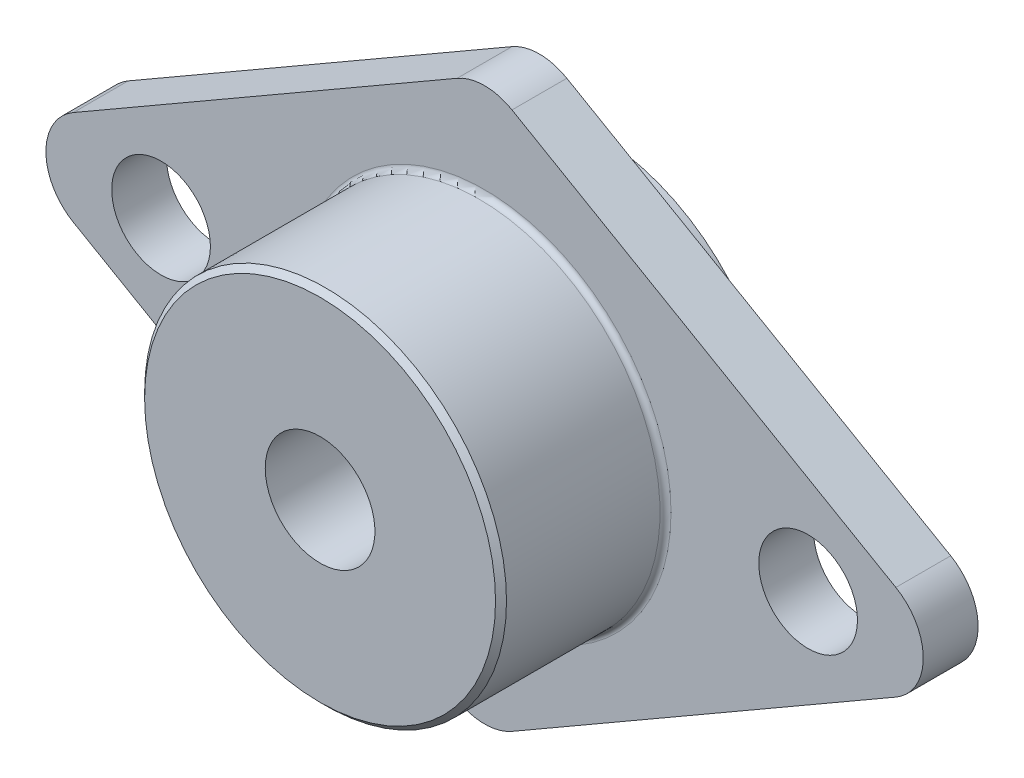
ISO-10303-21;
HEADER;
FILE_DESCRIPTION(('STEP AP214'),'2;1');
FILE_NAME('part.step','',(''),(''),'','','');
FILE_SCHEMA(('AUTOMOTIVE_DESIGN { 1 0 10303 214 1 1 1 1 }'));
ENDSEC;
DATA;
#1=APPLICATION_CONTEXT('core data for automotive mechanical design processes');
#2=APPLICATION_PROTOCOL_DEFINITION('international standard','automotive_design',2000,#1);
#3=PRODUCT_CONTEXT('',#1,'mechanical');
#4=PRODUCT('Part','Part','',(#3));
#5=PRODUCT_RELATED_PRODUCT_CATEGORY('part','',(#4));
#6=PRODUCT_DEFINITION_FORMATION('','',#4);
#7=PRODUCT_DEFINITION_CONTEXT('part definition',#1,'design');
#8=PRODUCT_DEFINITION('design','',#6,#7);
#9=PRODUCT_DEFINITION_SHAPE('','',#8);
#10=(LENGTH_UNIT() NAMED_UNIT(*) SI_UNIT(.MILLI.,.METRE.));
#11=(NAMED_UNIT(*) PLANE_ANGLE_UNIT() SI_UNIT($,.RADIAN.));
#12=(NAMED_UNIT(*) SI_UNIT($,.STERADIAN.) SOLID_ANGLE_UNIT());
#13=UNCERTAINTY_MEASURE_WITH_UNIT(LENGTH_MEASURE(1.E-05),#10,'distance_accuracy_value','');
#14=(GEOMETRIC_REPRESENTATION_CONTEXT(3) GLOBAL_UNCERTAINTY_ASSIGNED_CONTEXT((#13)) GLOBAL_UNIT_ASSIGNED_CONTEXT((#10,
#11,#12)) REPRESENTATION_CONTEXT('',''));
#15=CARTESIAN_POINT('',(0.,0.,0.));
#16=DIRECTION('',(0.,0.,1.));
#17=DIRECTION('',(1.,0.,0.));
#18=AXIS2_PLACEMENT_3D('',#15,#16,#17);
#19=CARTESIAN_POINT('',(0.,-20.2072594216368,5.));
#20=DIRECTION('',(0.,0.,-1.));
#21=DIRECTION('',(-1.,0.,0.));
#22=AXIS2_PLACEMENT_3D('',#19,#20,#21);
#23=CYLINDRICAL_SURFACE('',#22,5.);
#24=CARTESIAN_POINT('',(0.,-20.2072594216368,0.));
#25=DIRECTION('',(0.,0.,1.));
#26=DIRECTION('',(-1.,0.,0.));
#27=AXIS2_PLACEMENT_3D('',#24,#25,#26);
#28=CIRCLE('',#27,5.);
#29=CARTESIAN_POINT('',(-2.49999999999999,-24.537386440559,0.));
#30=VERTEX_POINT('',#29);
#31=CARTESIAN_POINT('',(2.49999999999999,-24.537386440559,0.));
#32=VERTEX_POINT('',#31);
#33=EDGE_CURVE('E145',#30,#32,#28,.T.);
#34=ORIENTED_EDGE('',*,*,#33,.T.);
#35=DIRECTION('',(0.,0.,-1.));
#36=VECTOR('',#35,1.);
#37=CARTESIAN_POINT('',(2.49999999999999,-24.537386440559,5.));
#38=LINE('',#37,#36);
#39=CARTESIAN_POINT('',(2.49999999999999,-24.537386440559,5.));
#40=VERTEX_POINT('',#39);
#41=EDGE_CURVE('E173',#40,#32,#38,.T.);
#42=ORIENTED_EDGE('',*,*,#41,.F.);
#43=CARTESIAN_POINT('',(0.,-20.2072594216368,5.));
#44=DIRECTION('',(0.,0.,1.));
#45=DIRECTION('',(-1.,0.,0.));
#46=AXIS2_PLACEMENT_3D('',#43,#44,#45);
#47=CIRCLE('',#46,5.);
#48=CARTESIAN_POINT('',(-2.49999999999999,-24.537386440559,5.));
#49=VERTEX_POINT('',#48);
#50=EDGE_CURVE('E160',#49,#40,#47,.T.);
#51=ORIENTED_EDGE('',*,*,#50,.F.);
#52=DIRECTION('',(0.,0.,-1.));
#53=VECTOR('',#52,1.);
#54=CARTESIAN_POINT('',(-2.49999999999999,-24.537386440559,5.));
#55=LINE('',#54,#53);
#56=EDGE_CURVE('E141',#49,#30,#55,.T.);
#57=ORIENTED_EDGE('',*,*,#56,.T.);
#58=EDGE_LOOP('',(#34,#42,#51,#57));
#59=FACE_BOUND('',#58,.T.);
#60=ADVANCED_FACE('F47',(#59),#23,.T.);
#61=CARTESIAN_POINT('',(37.4999999999999,-4.3301270189222,5.));
#62=DIRECTION('',(-0.499999999999998,0.86602540378444,0.));
#63=DIRECTION('',(-0.86602540378444,-0.499999999999998,0.));
#64=AXIS2_PLACEMENT_3D('',#61,#62,#63);
#65=PLANE('',#64);
#66=DIRECTION('',(0.86602540378444,0.499999999999998,0.));
#67=VECTOR('',#66,1.);
#68=CARTESIAN_POINT('',(37.4999999999999,-4.3301270189222,0.));
#69=LINE('',#68,#67);
#70=CARTESIAN_POINT('',(37.4999999999999,-4.3301270189222,0.));
#71=VERTEX_POINT('',#70);
#72=EDGE_CURVE('E148',#32,#71,#69,.T.);
#73=ORIENTED_EDGE('',*,*,#72,.T.);
#74=DIRECTION('',(0.,0.,-1.));
#75=VECTOR('',#74,1.);
#76=CARTESIAN_POINT('',(37.4999999999999,-4.3301270189222,5.));
#77=LINE('',#76,#75);
#78=CARTESIAN_POINT('',(37.4999999999999,-4.3301270189222,5.));
#79=VERTEX_POINT('',#78);
#80=EDGE_CURVE('E170',#79,#71,#77,.T.);
#81=ORIENTED_EDGE('',*,*,#80,.F.);
#82=DIRECTION('',(0.86602540378444,0.499999999999998,0.));
#83=VECTOR('',#82,1.);
#84=CARTESIAN_POINT('',(37.4999999999999,-4.3301270189222,5.));
#85=LINE('',#84,#83);
#86=EDGE_CURVE('E108',#40,#79,#85,.T.);
#87=ORIENTED_EDGE('',*,*,#86,.F.);
#88=ORIENTED_EDGE('',*,*,#41,.T.);
#89=EDGE_LOOP('',(#73,#81,#87,#88));
#90=FACE_BOUND('',#89,.T.);
#91=ADVANCED_FACE('F202',(#90),#65,.F.);
#92=CARTESIAN_POINT('',(35.,0.,5.));
#93=DIRECTION('',(0.,0.,-1.));
#94=DIRECTION('',(-1.,0.,0.));
#95=AXIS2_PLACEMENT_3D('',#92,#93,#94);
#96=CYLINDRICAL_SURFACE('',#95,5.);
#97=CARTESIAN_POINT('',(35.,0.,0.));
#98=DIRECTION('',(0.,0.,1.));
#99=DIRECTION('',(-1.,0.,0.));
#100=AXIS2_PLACEMENT_3D('',#97,#98,#99);
#101=CIRCLE('',#100,5.);
#102=CARTESIAN_POINT('',(37.4999999999999,4.33012701892221,0.));
#103=VERTEX_POINT('',#102);
#104=EDGE_CURVE('E151',#71,#103,#101,.T.);
#105=ORIENTED_EDGE('',*,*,#104,.T.);
#106=DIRECTION('',(0.,0.,-1.));
#107=VECTOR('',#106,1.);
#108=CARTESIAN_POINT('',(37.4999999999999,4.33012701892221,5.));
#109=LINE('',#108,#107);
#110=CARTESIAN_POINT('',(37.4999999999999,4.33012701892221,5.));
#111=VERTEX_POINT('',#110);
#112=EDGE_CURVE('E167',#111,#103,#109,.T.);
#113=ORIENTED_EDGE('',*,*,#112,.F.);
#114=CARTESIAN_POINT('',(35.,0.,5.));
#115=DIRECTION('',(0.,0.,1.));
#116=DIRECTION('',(-1.,0.,0.));
#117=AXIS2_PLACEMENT_3D('',#114,#115,#116);
#118=CIRCLE('',#117,5.);
#119=EDGE_CURVE('E242',#79,#111,#118,.T.);
#120=ORIENTED_EDGE('',*,*,#119,.F.);
#121=ORIENTED_EDGE('',*,*,#80,.T.);
#122=EDGE_LOOP('',(#105,#113,#120,#121));
#123=FACE_BOUND('',#122,.T.);
#124=ADVANCED_FACE('F208',(#123),#96,.T.);
#125=CARTESIAN_POINT('',(2.49999999999998,24.537386440559,5.));
#126=DIRECTION('',(-0.499999999999998,-0.86602540378444,0.));
#127=DIRECTION('',(0.86602540378444,-0.499999999999998,0.));
#128=AXIS2_PLACEMENT_3D('',#125,#126,#127);
#129=PLANE('',#128);
#130=DIRECTION('',(-0.86602540378444,0.499999999999998,0.));
#131=VECTOR('',#130,1.);
#132=CARTESIAN_POINT('',(2.49999999999998,24.537386440559,0.));
#133=LINE('',#132,#131);
#134=CARTESIAN_POINT('',(2.49999999999998,24.537386440559,0.));
#135=VERTEX_POINT('',#134);
#136=EDGE_CURVE('E153',#103,#135,#133,.T.);
#137=ORIENTED_EDGE('',*,*,#136,.T.);
#138=DIRECTION('',(0.,0.,-1.));
#139=VECTOR('',#138,1.);
#140=CARTESIAN_POINT('',(2.49999999999998,24.537386440559,5.));
#141=LINE('',#140,#139);
#142=CARTESIAN_POINT('',(2.49999999999998,24.537386440559,5.));
#143=VERTEX_POINT('',#142);
#144=EDGE_CURVE('E164',#143,#135,#141,.T.);
#145=ORIENTED_EDGE('',*,*,#144,.F.);
#146=DIRECTION('',(-0.86602540378444,0.499999999999998,0.));
#147=VECTOR('',#146,1.);
#148=CARTESIAN_POINT('',(2.49999999999998,24.537386440559,5.));
#149=LINE('',#148,#147);
#150=EDGE_CURVE('E244',#111,#143,#149,.T.);
#151=ORIENTED_EDGE('',*,*,#150,.F.);
#152=ORIENTED_EDGE('',*,*,#112,.T.);
#153=EDGE_LOOP('',(#137,#145,#151,#152));
#154=FACE_BOUND('',#153,.T.);
#155=ADVANCED_FACE('F250',(#154),#129,.F.);
#156=CARTESIAN_POINT('',(0.,20.2072594216368,5.));
#157=DIRECTION('',(0.,0.,-1.));
#158=DIRECTION('',(-1.,0.,0.));
#159=AXIS2_PLACEMENT_3D('',#156,#157,#158);
#160=CYLINDRICAL_SURFACE('',#159,5.);
#161=CARTESIAN_POINT('',(0.,20.2072594216368,0.));
#162=DIRECTION('',(0.,0.,1.));
#163=DIRECTION('',(1.,0.,0.));
#164=AXIS2_PLACEMENT_3D('',#161,#162,#163);
#165=CIRCLE('',#164,5.);
#166=CARTESIAN_POINT('',(-2.49999999999999,24.537386440559,0.));
#167=VERTEX_POINT('',#166);
#168=EDGE_CURVE('E155',#135,#167,#165,.T.);
#169=ORIENTED_EDGE('',*,*,#168,.T.);
#170=DIRECTION('',(0.,0.,-1.));
#171=VECTOR('',#170,1.);
#172=CARTESIAN_POINT('',(-2.49999999999999,24.537386440559,5.));
#173=LINE('',#172,#171);
#174=CARTESIAN_POINT('',(-2.49999999999999,24.537386440559,5.));
#175=VERTEX_POINT('',#174);
#176=EDGE_CURVE('E136',#175,#167,#173,.T.);
#177=ORIENTED_EDGE('',*,*,#176,.F.);
#178=CARTESIAN_POINT('',(0.,20.2072594216368,5.));
#179=DIRECTION('',(0.,0.,1.));
#180=DIRECTION('',(1.,0.,0.));
#181=AXIS2_PLACEMENT_3D('',#178,#179,#180);
#182=CIRCLE('',#181,5.);
#183=EDGE_CURVE('E127',#143,#175,#182,.T.);
#184=ORIENTED_EDGE('',*,*,#183,.F.);
#185=ORIENTED_EDGE('',*,*,#144,.T.);
#186=EDGE_LOOP('',(#169,#177,#184,#185));
#187=FACE_BOUND('',#186,.T.);
#188=ADVANCED_FACE('F254',(#187),#160,.T.);
#189=CARTESIAN_POINT('',(-37.5,4.3301270189222,5.));
#190=DIRECTION('',(0.499999999999998,-0.86602540378444,0.));
#191=DIRECTION('',(0.86602540378444,0.499999999999998,0.));
#192=AXIS2_PLACEMENT_3D('',#189,#190,#191);
#193=PLANE('',#192);
#194=DIRECTION('',(-0.86602540378444,-0.499999999999998,0.));
#195=VECTOR('',#194,1.);
#196=CARTESIAN_POINT('',(-37.5,4.3301270189222,0.));
#197=LINE('',#196,#195);
#198=CARTESIAN_POINT('',(-37.5,4.3301270189222,0.));
#199=VERTEX_POINT('',#198);
#200=EDGE_CURVE('E135',#167,#199,#197,.T.);
#201=ORIENTED_EDGE('',*,*,#200,.T.);
#202=DIRECTION('',(0.,0.,-1.));
#203=VECTOR('',#202,1.);
#204=CARTESIAN_POINT('',(-37.5,4.3301270189222,5.));
#205=LINE('',#204,#203);
#206=CARTESIAN_POINT('',(-37.5,4.3301270189222,5.));
#207=VERTEX_POINT('',#206);
#208=EDGE_CURVE('E132',#207,#199,#205,.T.);
#209=ORIENTED_EDGE('',*,*,#208,.F.);
#210=DIRECTION('',(-0.86602540378444,-0.499999999999998,0.));
#211=VECTOR('',#210,1.);
#212=CARTESIAN_POINT('',(-37.5,4.3301270189222,5.));
#213=LINE('',#212,#211);
#214=EDGE_CURVE('E121',#175,#207,#213,.T.);
#215=ORIENTED_EDGE('',*,*,#214,.F.);
#216=ORIENTED_EDGE('',*,*,#176,.T.);
#217=EDGE_LOOP('',(#201,#209,#215,#216));
#218=FACE_BOUND('',#217,.T.);
#219=ADVANCED_FACE('F133',(#218),#193,.F.);
#220=CARTESIAN_POINT('',(-35.,0.,5.));
#221=DIRECTION('',(0.,0.,-1.));
#222=DIRECTION('',(-1.,0.,0.));
#223=AXIS2_PLACEMENT_3D('',#220,#221,#222);
#224=CYLINDRICAL_SURFACE('',#223,5.);
#225=CARTESIAN_POINT('',(-35.,0.,0.));
#226=DIRECTION('',(0.,0.,1.));
#227=DIRECTION('',(1.,0.,0.));
#228=AXIS2_PLACEMENT_3D('',#225,#226,#227);
#229=CIRCLE('',#228,5.);
#230=CARTESIAN_POINT('',(-37.5,-4.3301270189222,0.));
#231=VERTEX_POINT('',#230);
#232=EDGE_CURVE('E93',#199,#231,#229,.T.);
#233=ORIENTED_EDGE('',*,*,#232,.T.);
#234=DIRECTION('',(0.,0.,-1.));
#235=VECTOR('',#234,1.);
#236=CARTESIAN_POINT('',(-37.5,-4.3301270189222,5.));
#237=LINE('',#236,#235);
#238=CARTESIAN_POINT('',(-37.5,-4.3301270189222,5.));
#239=VERTEX_POINT('',#238);
#240=EDGE_CURVE('E137',#239,#231,#237,.T.);
#241=ORIENTED_EDGE('',*,*,#240,.F.);
#242=CARTESIAN_POINT('',(-35.,0.,5.));
#243=DIRECTION('',(0.,0.,1.));
#244=DIRECTION('',(1.,0.,0.));
#245=AXIS2_PLACEMENT_3D('',#242,#243,#244);
#246=CIRCLE('',#245,5.);
#247=EDGE_CURVE('E125',#207,#239,#246,.T.);
#248=ORIENTED_EDGE('',*,*,#247,.F.);
#249=ORIENTED_EDGE('',*,*,#208,.T.);
#250=EDGE_LOOP('',(#233,#241,#248,#249));
#251=FACE_BOUND('',#250,.T.);
#252=ADVANCED_FACE('F139',(#251),#224,.T.);
#253=CARTESIAN_POINT('',(-2.49999999999999,-24.537386440559,5.));
#254=DIRECTION('',(0.499999999999998,0.86602540378444,0.));
#255=DIRECTION('',(-0.86602540378444,0.499999999999998,0.));
#256=AXIS2_PLACEMENT_3D('',#253,#254,#255);
#257=PLANE('',#256);
#258=DIRECTION('',(0.86602540378444,-0.499999999999998,0.));
#259=VECTOR('',#258,1.);
#260=CARTESIAN_POINT('',(-2.49999999999999,-24.537386440559,0.));
#261=LINE('',#260,#259);
#262=EDGE_CURVE('E99',#231,#30,#261,.T.);
#263=ORIENTED_EDGE('',*,*,#262,.T.);
#264=ORIENTED_EDGE('',*,*,#56,.F.);
#265=DIRECTION('',(0.86602540378444,-0.499999999999998,0.));
#266=VECTOR('',#265,1.);
#267=CARTESIAN_POINT('',(-2.49999999999999,-24.537386440559,5.));
#268=LINE('',#267,#266);
#269=EDGE_CURVE('E64',#239,#49,#268,.T.);
#270=ORIENTED_EDGE('',*,*,#269,.F.);
#271=ORIENTED_EDGE('',*,*,#240,.T.);
#272=EDGE_LOOP('',(#263,#264,#270,#271));
#273=FACE_BOUND('',#272,.T.);
#274=ADVANCED_FACE('F261',(#273),#257,.F.);
#275=CARTESIAN_POINT('',(0.,-20.2072594216368,5.));
#276=DIRECTION('',(0.,0.,-1.));
#277=DIRECTION('',(-1.,0.,0.));
#278=AXIS2_PLACEMENT_3D('',#275,#276,#277);
#279=PLANE('',#278);
#280=CARTESIAN_POINT('',(0.,0.,5.));
#281=DIRECTION('',(0.,0.,-1.));
#282=DIRECTION('',(-1.,0.,0.));
#283=AXIS2_PLACEMENT_3D('',#280,#281,#282);
#284=CIRCLE('',#283,17.);
#285=CARTESIAN_POINT('',(-17.,0.,5.));
#286=VERTEX_POINT('',#285);
#287=EDGE_CURVE('E184',#286,#286,#284,.T.);
#288=ORIENTED_EDGE('',*,*,#287,.T.);
#289=EDGE_LOOP('',(#288));
#290=FACE_BOUND('',#289,.T.);
#291=CARTESIAN_POINT('',(-29.5,0.,5.));
#292=DIRECTION('',(0.,0.,1.));
#293=DIRECTION('',(1.,0.,0.));
#294=AXIS2_PLACEMENT_3D('',#291,#292,#293);
#295=CIRCLE('',#294,4.5);
#296=CARTESIAN_POINT('',(-25.,0.,5.));
#297=VERTEX_POINT('',#296);
#298=EDGE_CURVE('E411',#297,#297,#295,.T.);
#299=ORIENTED_EDGE('',*,*,#298,.F.);
#300=EDGE_LOOP('',(#299));
#301=FACE_BOUND('',#300,.T.);
#302=CARTESIAN_POINT('',(29.5,0.,5.));
#303=DIRECTION('',(0.,0.,1.));
#304=DIRECTION('',(1.,0.,0.));
#305=AXIS2_PLACEMENT_3D('',#302,#303,#304);
#306=CIRCLE('',#305,4.5);
#307=CARTESIAN_POINT('',(34.,0.,5.));
#308=VERTEX_POINT('',#307);
#309=EDGE_CURVE('E405',#308,#308,#306,.T.);
#310=ORIENTED_EDGE('',*,*,#309,.F.);
#311=EDGE_LOOP('',(#310));
#312=FACE_BOUND('',#311,.T.);
#313=ORIENTED_EDGE('',*,*,#50,.T.);
#314=ORIENTED_EDGE('',*,*,#86,.T.);
#315=ORIENTED_EDGE('',*,*,#119,.T.);
#316=ORIENTED_EDGE('',*,*,#150,.T.);
#317=ORIENTED_EDGE('',*,*,#183,.T.);
#318=ORIENTED_EDGE('',*,*,#214,.T.);
#319=ORIENTED_EDGE('',*,*,#247,.T.);
#320=ORIENTED_EDGE('',*,*,#269,.T.);
#321=EDGE_LOOP('',(#313,#314,#315,#316,#317,#318,#319,#320));
#322=FACE_BOUND('',#321,.T.);
#323=ADVANCED_FACE('F123',(#290,#301,#312,#322),#279,.F.);
#324=CARTESIAN_POINT('',(0.,-20.2072594216368,0.));
#325=DIRECTION('',(0.,0.,-1.));
#326=DIRECTION('',(-1.,0.,0.));
#327=AXIS2_PLACEMENT_3D('',#324,#325,#326);
#328=PLANE('',#327);
#329=CARTESIAN_POINT('',(0.,0.,0.));
#330=DIRECTION('',(0.,0.,-1.));
#331=DIRECTION('',(-1.,0.,0.));
#332=AXIS2_PLACEMENT_3D('',#329,#330,#331);
#333=CIRCLE('',#332,17.);
#334=CARTESIAN_POINT('',(-17.,0.,0.));
#335=VERTEX_POINT('',#334);
#336=EDGE_CURVE('E178',#335,#335,#333,.F.);
#337=ORIENTED_EDGE('',*,*,#336,.T.);
#338=EDGE_LOOP('',(#337));
#339=FACE_BOUND('',#338,.T.);
#340=CARTESIAN_POINT('',(-29.5,0.,0.));
#341=DIRECTION('',(0.,0.,1.));
#342=DIRECTION('',(1.,0.,0.));
#343=AXIS2_PLACEMENT_3D('',#340,#341,#342);
#344=CIRCLE('',#343,4.5);
#345=CARTESIAN_POINT('',(-25.,0.,0.));
#346=VERTEX_POINT('',#345);
#347=EDGE_CURVE('E401',#346,#346,#344,.T.);
#348=ORIENTED_EDGE('',*,*,#347,.T.);
#349=EDGE_LOOP('',(#348));
#350=FACE_BOUND('',#349,.T.);
#351=CARTESIAN_POINT('',(29.5,0.,0.));
#352=DIRECTION('',(0.,0.,1.));
#353=DIRECTION('',(1.,0.,0.));
#354=AXIS2_PLACEMENT_3D('',#351,#352,#353);
#355=CIRCLE('',#354,4.5);
#356=CARTESIAN_POINT('',(34.,0.,0.));
#357=VERTEX_POINT('',#356);
#358=EDGE_CURVE('E404',#357,#357,#355,.T.);
#359=ORIENTED_EDGE('',*,*,#358,.T.);
#360=EDGE_LOOP('',(#359));
#361=FACE_BOUND('',#360,.T.);
#362=ORIENTED_EDGE('',*,*,#33,.F.);
#363=ORIENTED_EDGE('',*,*,#262,.F.);
#364=ORIENTED_EDGE('',*,*,#232,.F.);
#365=ORIENTED_EDGE('',*,*,#200,.F.);
#366=ORIENTED_EDGE('',*,*,#168,.F.);
#367=ORIENTED_EDGE('',*,*,#136,.F.);
#368=ORIENTED_EDGE('',*,*,#104,.F.);
#369=ORIENTED_EDGE('',*,*,#72,.F.);
#370=EDGE_LOOP('',(#362,#363,#364,#365,#366,#367,#368,#369));
#371=FACE_BOUND('',#370,.T.);
#372=ADVANCED_FACE('F257',(#339,#350,#361,#371),#328,.T.);
#373=CARTESIAN_POINT('',(0.,0.,20.));
#374=DIRECTION('',(0.,0.,-1.));
#375=DIRECTION('',(-1.,0.,0.));
#376=AXIS2_PLACEMENT_3D('',#373,#374,#375);
#377=CYLINDRICAL_SURFACE('',#376,16.5);
#378=CARTESIAN_POINT('',(0.,0.,19.5));
#379=DIRECTION('',(0.,0.,1.));
#380=DIRECTION('',(1.,0.,0.));
#381=AXIS2_PLACEMENT_3D('',#378,#379,#380);
#382=CIRCLE('',#381,16.5);
#383=CARTESIAN_POINT('',(16.5,0.,19.5));
#384=VERTEX_POINT('',#383);
#385=EDGE_CURVE('E13',#384,#384,#382,.F.);
#386=ORIENTED_EDGE('',*,*,#385,.T.);
#387=EDGE_LOOP('',(#386));
#388=FACE_BOUND('',#387,.T.);
#389=CARTESIAN_POINT('',(0.,0.,5.5));
#390=DIRECTION('',(0.,0.,-1.));
#391=DIRECTION('',(-1.,0.,0.));
#392=AXIS2_PLACEMENT_3D('',#389,#390,#391);
#393=CIRCLE('',#392,16.5);
#394=CARTESIAN_POINT('',(-16.5,0.,5.5));
#395=VERTEX_POINT('',#394);
#396=EDGE_CURVE('E181',#395,#395,#393,.F.);
#397=ORIENTED_EDGE('',*,*,#396,.T.);
#398=EDGE_LOOP('',(#397));
#399=FACE_BOUND('',#398,.T.);
#400=ADVANCED_FACE('F355',(#388,#399),#377,.T.);
#401=CARTESIAN_POINT('',(0.,0.,20.));
#402=DIRECTION('',(0.,0.,1.));
#403=DIRECTION('',(1.,0.,0.));
#404=AXIS2_PLACEMENT_3D('',#401,#402,#403);
#405=PLANE('',#404);
#406=CARTESIAN_POINT('',(0.,0.,20.));
#407=DIRECTION('',(0.,0.,1.));
#408=DIRECTION('',(1.,0.,0.));
#409=AXIS2_PLACEMENT_3D('',#406,#407,#408);
#410=CIRCLE('',#409,16.);
#411=CARTESIAN_POINT('',(16.,0.,20.));
#412=VERTEX_POINT('',#411);
#413=EDGE_CURVE('E56',#412,#412,#410,.T.);
#414=ORIENTED_EDGE('',*,*,#413,.T.);
#415=EDGE_LOOP('',(#414));
#416=FACE_BOUND('',#415,.T.);
#417=CARTESIAN_POINT('',(0.,0.,20.));
#418=DIRECTION('',(0.,0.,-1.));
#419=DIRECTION('',(-1.,0.,0.));
#420=AXIS2_PLACEMENT_3D('',#417,#418,#419);
#421=CIRCLE('',#420,5.);
#422=CARTESIAN_POINT('',(-5.,0.,20.));
#423=VERTEX_POINT('',#422);
#424=EDGE_CURVE('E233',#423,#423,#421,.T.);
#425=ORIENTED_EDGE('',*,*,#424,.T.);
#426=EDGE_LOOP('',(#425));
#427=FACE_BOUND('',#426,.T.);
#428=ADVANCED_FACE('F189',(#416,#427),#405,.T.);
#429=CARTESIAN_POINT('',(0.,0.,-5.));
#430=DIRECTION('',(0.,0.,1.));
#431=DIRECTION('',(1.,0.,0.));
#432=AXIS2_PLACEMENT_3D('',#429,#430,#431);
#433=CYLINDRICAL_SURFACE('',#432,16.5);
#434=CARTESIAN_POINT('',(0.,0.,-0.5));
#435=DIRECTION('',(0.,0.,-1.));
#436=DIRECTION('',(-1.,0.,0.));
#437=AXIS2_PLACEMENT_3D('',#434,#435,#436);
#438=CIRCLE('',#437,16.5);
#439=CARTESIAN_POINT('',(-16.5,0.,-0.5));
#440=VERTEX_POINT('',#439);
#441=EDGE_CURVE('E175',#440,#440,#438,.T.);
#442=ORIENTED_EDGE('',*,*,#441,.T.);
#443=EDGE_LOOP('',(#442));
#444=FACE_BOUND('',#443,.T.);
#445=CARTESIAN_POINT('',(0.,0.,-5.));
#446=DIRECTION('',(0.,0.,-1.));
#447=DIRECTION('',(-1.,0.,0.));
#448=AXIS2_PLACEMENT_3D('',#445,#446,#447);
#449=CIRCLE('',#448,16.5);
#450=CARTESIAN_POINT('',(-16.5,0.,-5.));
#451=VERTEX_POINT('',#450);
#452=EDGE_CURVE('E149',#451,#451,#449,.T.);
#453=ORIENTED_EDGE('',*,*,#452,.F.);
#454=EDGE_LOOP('',(#453));
#455=FACE_BOUND('',#454,.T.);
#456=ADVANCED_FACE('F225',(#444,#455),#433,.T.);
#457=CARTESIAN_POINT('',(0.,0.,-5.));
#458=DIRECTION('',(0.,0.,-1.));
#459=DIRECTION('',(-1.,0.,0.));
#460=AXIS2_PLACEMENT_3D('',#457,#458,#459);
#461=PLANE('',#460);
#462=CARTESIAN_POINT('',(0.,0.,-5.));
#463=DIRECTION('',(0.,0.,-1.));
#464=DIRECTION('',(-1.,0.,0.));
#465=AXIS2_PLACEMENT_3D('',#462,#463,#464);
#466=CIRCLE('',#465,5.);
#467=CARTESIAN_POINT('',(-5.,0.,-5.));
#468=VERTEX_POINT('',#467);
#469=EDGE_CURVE('E236',#468,#468,#466,.T.);
#470=ORIENTED_EDGE('',*,*,#469,.F.);
#471=EDGE_LOOP('',(#470));
#472=FACE_BOUND('',#471,.T.);
#473=ORIENTED_EDGE('',*,*,#452,.T.);
#474=EDGE_LOOP('',(#473));
#475=FACE_BOUND('',#474,.T.);
#476=ADVANCED_FACE('F228',(#472,#475),#461,.T.);
#477=CARTESIAN_POINT('',(0.,0.,20.));
#478=DIRECTION('',(0.,0.,-1.));
#479=DIRECTION('',(-1.,0.,0.));
#480=AXIS2_PLACEMENT_3D('',#477,#478,#479);
#481=CYLINDRICAL_SURFACE('',#480,5.);
#482=ORIENTED_EDGE('',*,*,#424,.F.);
#483=EDGE_LOOP('',(#482));
#484=FACE_BOUND('',#483,.T.);
#485=ORIENTED_EDGE('',*,*,#469,.T.);
#486=EDGE_LOOP('',(#485));
#487=FACE_BOUND('',#486,.T.);
#488=ADVANCED_FACE('F314',(#484,#487),#481,.F.);
#489=CARTESIAN_POINT('',(29.5,0.,0.));
#490=DIRECTION('',(0.,0.,1.));
#491=DIRECTION('',(1.,0.,0.));
#492=AXIS2_PLACEMENT_3D('',#489,#490,#491);
#493=CYLINDRICAL_SURFACE('',#492,4.5);
#494=ORIENTED_EDGE('',*,*,#358,.F.);
#495=EDGE_LOOP('',(#494));
#496=FACE_BOUND('',#495,.T.);
#497=ORIENTED_EDGE('',*,*,#309,.T.);
#498=EDGE_LOOP('',(#497));
#499=FACE_BOUND('',#498,.T.);
#500=ADVANCED_FACE('F218',(#496,#499),#493,.F.);
#501=CARTESIAN_POINT('',(-29.5,0.,0.));
#502=DIRECTION('',(0.,0.,1.));
#503=DIRECTION('',(1.,0.,0.));
#504=AXIS2_PLACEMENT_3D('',#501,#502,#503);
#505=CYLINDRICAL_SURFACE('',#504,4.5);
#506=ORIENTED_EDGE('',*,*,#347,.F.);
#507=EDGE_LOOP('',(#506));
#508=FACE_BOUND('',#507,.T.);
#509=ORIENTED_EDGE('',*,*,#298,.T.);
#510=EDGE_LOOP('',(#509));
#511=FACE_BOUND('',#510,.T.);
#512=ADVANCED_FACE('F213',(#508,#511),#505,.F.);
#513=CARTESIAN_POINT('',(0.,0.,-0.5));
#514=DIRECTION('',(0.,0.,-1.));
#515=DIRECTION('',(-1.,0.,0.));
#516=AXIS2_PLACEMENT_3D('',#513,#514,#515);
#517=TOROIDAL_SURFACE('',#516,17.,0.5);
#518=ORIENTED_EDGE('',*,*,#336,.F.);
#519=EDGE_LOOP('',(#518));
#520=FACE_BOUND('',#519,.T.);
#521=ORIENTED_EDGE('',*,*,#441,.F.);
#522=EDGE_LOOP('',(#521));
#523=FACE_BOUND('',#522,.T.);
#524=ADVANCED_FACE('F198',(#520,#523),#517,.F.);
#525=CARTESIAN_POINT('',(0.,0.,5.5));
#526=DIRECTION('',(0.,0.,-1.));
#527=DIRECTION('',(-1.,0.,0.));
#528=AXIS2_PLACEMENT_3D('',#525,#526,#527);
#529=TOROIDAL_SURFACE('',#528,17.,0.5);
#530=ORIENTED_EDGE('',*,*,#287,.F.);
#531=EDGE_LOOP('',(#530));
#532=FACE_BOUND('',#531,.T.);
#533=ORIENTED_EDGE('',*,*,#396,.F.);
#534=EDGE_LOOP('',(#533));
#535=FACE_BOUND('',#534,.T.);
#536=ADVANCED_FACE('F193',(#532,#535),#529,.F.);
#537=CARTESIAN_POINT('',(0.,0.,20.));
#538=DIRECTION('',(0.,0.,-1.));
#539=DIRECTION('',(-1.,0.,0.));
#540=AXIS2_PLACEMENT_3D('',#537,#538,#539);
#541=CONICAL_SURFACE('',#540,16.,0.785398163397441);
#542=ORIENTED_EDGE('',*,*,#385,.F.);
#543=EDGE_LOOP('',(#542));
#544=FACE_BOUND('',#543,.T.);
#545=ORIENTED_EDGE('',*,*,#413,.F.);
#546=EDGE_LOOP('',(#545));
#547=FACE_BOUND('',#546,.T.);
#548=ADVANCED_FACE('F49',(#544,#547),#541,.T.);
#549=CLOSED_SHELL('',(#60,#91,#124,#155,#188,#219,#252,#274,#323,#372,#400,#428,#456,#476,#488,
#500,#512,#524,#536,#548));
#550=MANIFOLD_SOLID_BREP('B2',#549);
#551=ADVANCED_BREP_SHAPE_REPRESENTATION('',(#18,#550),#14);
#552=SHAPE_DEFINITION_REPRESENTATION(#9,#551);
ENDSEC;
END-ISO-10303-21;
